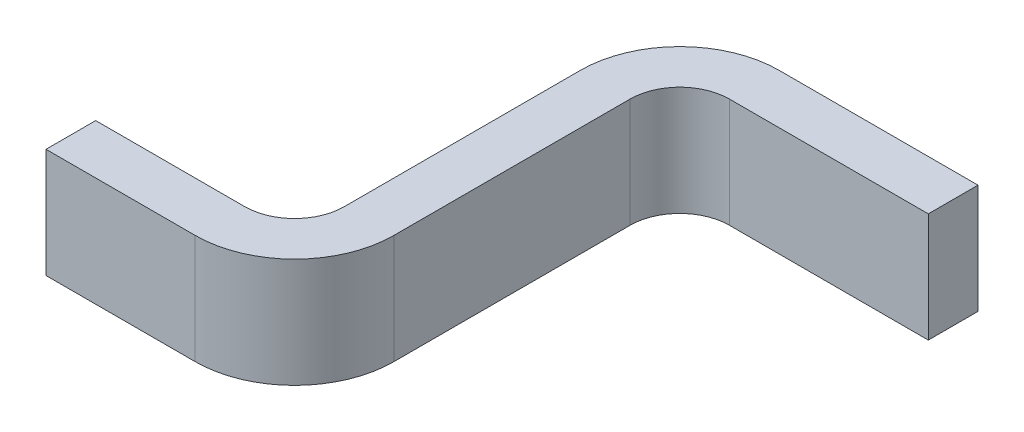
ISO-10303-21;
HEADER;
FILE_DESCRIPTION(('STEP AP214'),'2;1');
FILE_NAME('part.step','',(''),(''),'','','');
FILE_SCHEMA(('AUTOMOTIVE_DESIGN { 1 0 10303 214 1 1 1 1 }'));
ENDSEC;
DATA;
#1=APPLICATION_CONTEXT('core data for automotive mechanical design processes');
#2=APPLICATION_PROTOCOL_DEFINITION('international standard','automotive_design',2000,#1);
#3=PRODUCT_CONTEXT('',#1,'mechanical');
#4=PRODUCT('Part','Part','',(#3));
#5=PRODUCT_RELATED_PRODUCT_CATEGORY('part','',(#4));
#6=PRODUCT_DEFINITION_FORMATION('','',#4);
#7=PRODUCT_DEFINITION_CONTEXT('part definition',#1,'design');
#8=PRODUCT_DEFINITION('design','',#6,#7);
#9=PRODUCT_DEFINITION_SHAPE('','',#8);
#10=(LENGTH_UNIT() NAMED_UNIT(*) SI_UNIT(.MILLI.,.METRE.));
#11=(NAMED_UNIT(*) PLANE_ANGLE_UNIT() SI_UNIT($,.RADIAN.));
#12=(NAMED_UNIT(*) SI_UNIT($,.STERADIAN.) SOLID_ANGLE_UNIT());
#13=UNCERTAINTY_MEASURE_WITH_UNIT(LENGTH_MEASURE(1.E-05),#10,'distance_accuracy_value','');
#14=(GEOMETRIC_REPRESENTATION_CONTEXT(3) GLOBAL_UNCERTAINTY_ASSIGNED_CONTEXT((#13)) GLOBAL_UNIT_ASSIGNED_CONTEXT((#10,
#11,#12)) REPRESENTATION_CONTEXT('',''));
#15=CARTESIAN_POINT('',(0.,0.,0.));
#16=DIRECTION('',(0.,0.,1.));
#17=DIRECTION('',(1.,0.,0.));
#18=AXIS2_PLACEMENT_3D('',#15,#16,#17);
#19=CARTESIAN_POINT('',(3.9,-2.64,0.675));
#20=DIRECTION('',(0.,-1.,0.));
#21=DIRECTION('',(0.,0.,-1.));
#22=AXIS2_PLACEMENT_3D('',#19,#20,#21);
#23=PLANE('',#22);
#24=CARTESIAN_POINT('',(3.80000000000001,-2.64000000000001,0.675));
#25=DIRECTION('',(0.,-1.,0.));
#26=DIRECTION('',(0.,0.,-1.));
#27=AXIS2_PLACEMENT_3D('',#24,#25,#26);
#28=CIRCLE('',#27,0.1);
#29=CARTESIAN_POINT('',(3.9,-2.64,0.675));
#30=VERTEX_POINT('',#29);
#31=CARTESIAN_POINT('',(3.80000000000001,-2.64000000000001,0.775));
#32=VERTEX_POINT('',#31);
#33=EDGE_CURVE('E162',#30,#32,#28,.T.);
#34=ORIENTED_EDGE('',*,*,#33,.T.);
#35=DIRECTION('',(1.,0.,0.));
#36=VECTOR('',#35,1.);
#37=CARTESIAN_POINT('',(3.5,-2.64,0.775));
#38=LINE('',#37,#36);
#39=CARTESIAN_POINT('',(3.5,-2.64,0.775));
#40=VERTEX_POINT('',#39);
#41=EDGE_CURVE('E120',#32,#40,#38,.F.);
#42=ORIENTED_EDGE('',*,*,#41,.T.);
#43=DIRECTION('',(0.,0.,1.));
#44=VECTOR('',#43,1.);
#45=CARTESIAN_POINT('',(3.5,-2.64,0.775));
#46=LINE('',#45,#44);
#47=CARTESIAN_POINT('',(3.5,-2.64,0.875));
#48=VERTEX_POINT('',#47);
#49=EDGE_CURVE('E116',#48,#40,#46,.F.);
#50=ORIENTED_EDGE('',*,*,#49,.F.);
#51=DIRECTION('',(-1.,0.,0.));
#52=VECTOR('',#51,1.);
#53=CARTESIAN_POINT('',(3.5,-2.64,0.875));
#54=LINE('',#53,#52);
#55=CARTESIAN_POINT('',(3.80000000000001,-2.64000000000001,0.875));
#56=VERTEX_POINT('',#55);
#57=EDGE_CURVE('E111',#48,#56,#54,.F.);
#58=ORIENTED_EDGE('',*,*,#57,.T.);
#59=CARTESIAN_POINT('',(3.80000000000001,-2.64000000000001,0.675));
#60=DIRECTION('',(0.,-1.,0.));
#61=DIRECTION('',(0.,0.,-1.));
#62=AXIS2_PLACEMENT_3D('',#59,#60,#61);
#63=CIRCLE('',#62,0.2);
#64=CARTESIAN_POINT('',(4.,-2.64,0.675));
#65=VERTEX_POINT('',#64);
#66=EDGE_CURVE('E102',#65,#56,#63,.T.);
#67=ORIENTED_EDGE('',*,*,#66,.F.);
#68=DIRECTION('',(0.,0.,1.));
#69=VECTOR('',#68,1.);
#70=CARTESIAN_POINT('',(4.,-2.64,0.675));
#71=LINE('',#70,#69);
#72=CARTESIAN_POINT('',(4.,-2.64,0.2));
#73=VERTEX_POINT('',#72);
#74=EDGE_CURVE('E98',#65,#73,#71,.F.);
#75=ORIENTED_EDGE('',*,*,#74,.T.);
#76=CARTESIAN_POINT('',(4.1,-2.64,0.2));
#77=DIRECTION('',(0.,1.,0.));
#78=DIRECTION('',(0.,0.,1.));
#79=AXIS2_PLACEMENT_3D('',#76,#77,#78);
#80=CIRCLE('',#79,0.1);
#81=CARTESIAN_POINT('',(4.1,-2.64,0.1));
#82=VERTEX_POINT('',#81);
#83=EDGE_CURVE('E20',#73,#82,#80,.F.);
#84=ORIENTED_EDGE('',*,*,#83,.T.);
#85=DIRECTION('',(-1.,0.,0.));
#86=VECTOR('',#85,1.);
#87=CARTESIAN_POINT('',(4.1,-2.64,0.1));
#88=LINE('',#87,#86);
#89=CARTESIAN_POINT('',(4.5,-2.64,0.1));
#90=VERTEX_POINT('',#89);
#91=EDGE_CURVE('E145',#82,#90,#88,.F.);
#92=ORIENTED_EDGE('',*,*,#91,.T.);
#93=DIRECTION('',(0.,0.,1.));
#94=VECTOR('',#93,1.);
#95=CARTESIAN_POINT('',(4.5,-2.64,0.));
#96=LINE('',#95,#94);
#97=CARTESIAN_POINT('',(4.5,-2.64,0.));
#98=VERTEX_POINT('',#97);
#99=EDGE_CURVE('E139',#90,#98,#96,.F.);
#100=ORIENTED_EDGE('',*,*,#99,.T.);
#101=DIRECTION('',(1.,0.,0.));
#102=VECTOR('',#101,1.);
#103=CARTESIAN_POINT('',(4.1,-2.64,0.));
#104=LINE('',#103,#102);
#105=CARTESIAN_POINT('',(4.1,-2.64,0.));
#106=VERTEX_POINT('',#105);
#107=EDGE_CURVE('E132',#98,#106,#104,.F.);
#108=ORIENTED_EDGE('',*,*,#107,.T.);
#109=CARTESIAN_POINT('',(4.1,-2.64,0.2));
#110=DIRECTION('',(0.,1.,0.));
#111=DIRECTION('',(0.,0.,1.));
#112=AXIS2_PLACEMENT_3D('',#109,#110,#111);
#113=CIRCLE('',#112,0.2);
#114=CARTESIAN_POINT('',(3.9,-2.64,0.2));
#115=VERTEX_POINT('',#114);
#116=EDGE_CURVE('E135',#115,#106,#113,.F.);
#117=ORIENTED_EDGE('',*,*,#116,.F.);
#118=DIRECTION('',(0.,0.,-1.));
#119=VECTOR('',#118,1.);
#120=CARTESIAN_POINT('',(3.9,-2.64,0.675));
#121=LINE('',#120,#119);
#122=EDGE_CURVE('E128',#115,#30,#121,.F.);
#123=ORIENTED_EDGE('',*,*,#122,.T.);
#124=EDGE_LOOP('',(#34,#42,#50,#58,#67,#75,#84,#92,#100,#108,#117,#123));
#125=FACE_BOUND('',#124,.T.);
#126=ADVANCED_FACE('F17',(#125),#23,.F.);
#127=CARTESIAN_POINT('',(4.1,-2.64,0.2));
#128=DIRECTION('',(0.,1.,0.));
#129=DIRECTION('',(0.,0.,1.));
#130=AXIS2_PLACEMENT_3D('',#127,#128,#129);
#131=CYLINDRICAL_SURFACE('',#130,0.1);
#132=DIRECTION('',(0.,1.,0.));
#133=VECTOR('',#132,1.);
#134=CARTESIAN_POINT('',(4.,-2.64,0.2));
#135=LINE('',#134,#133);
#136=CARTESIAN_POINT('',(4.,-2.86,0.2));
#137=VERTEX_POINT('',#136);
#138=EDGE_CURVE('E91',#73,#137,#135,.F.);
#139=ORIENTED_EDGE('',*,*,#138,.T.);
#140=CARTESIAN_POINT('',(4.1,-2.86,0.2));
#141=DIRECTION('',(0.,1.,0.));
#142=DIRECTION('',(0.,0.,1.));
#143=AXIS2_PLACEMENT_3D('',#140,#141,#142);
#144=CIRCLE('',#143,0.1);
#145=CARTESIAN_POINT('',(4.1,-2.86,0.1));
#146=VERTEX_POINT('',#145);
#147=EDGE_CURVE('E103',#137,#146,#144,.F.);
#148=ORIENTED_EDGE('',*,*,#147,.T.);
#149=DIRECTION('',(0.,1.,0.));
#150=VECTOR('',#149,1.);
#151=CARTESIAN_POINT('',(4.1,-2.64,0.1));
#152=LINE('',#151,#150);
#153=EDGE_CURVE('E92',#146,#82,#152,.T.);
#154=ORIENTED_EDGE('',*,*,#153,.T.);
#155=ORIENTED_EDGE('',*,*,#83,.F.);
#156=EDGE_LOOP('',(#139,#148,#154,#155));
#157=FACE_BOUND('',#156,.T.);
#158=ADVANCED_FACE('F89',(#157),#131,.F.);
#159=CARTESIAN_POINT('',(4.1,-2.64,0.1));
#160=DIRECTION('',(0.,0.,-1.));
#161=DIRECTION('',(-1.,0.,0.));
#162=AXIS2_PLACEMENT_3D('',#159,#160,#161);
#163=PLANE('',#162);
#164=ORIENTED_EDGE('',*,*,#153,.F.);
#165=DIRECTION('',(1.,0.,0.));
#166=VECTOR('',#165,1.);
#167=CARTESIAN_POINT('',(4.,-2.86,0.1));
#168=LINE('',#167,#166);
#169=CARTESIAN_POINT('',(4.5,-2.86,0.1));
#170=VERTEX_POINT('',#169);
#171=EDGE_CURVE('E105',#146,#170,#168,.T.);
#172=ORIENTED_EDGE('',*,*,#171,.T.);
#173=DIRECTION('',(0.,1.,0.));
#174=VECTOR('',#173,1.);
#175=CARTESIAN_POINT('',(4.5,-2.86,0.1));
#176=LINE('',#175,#174);
#177=EDGE_CURVE('E142',#170,#90,#176,.T.);
#178=ORIENTED_EDGE('',*,*,#177,.T.);
#179=ORIENTED_EDGE('',*,*,#91,.F.);
#180=EDGE_LOOP('',(#164,#172,#178,#179));
#181=FACE_BOUND('',#180,.T.);
#182=ADVANCED_FACE('F187',(#181),#163,.F.);
#183=CARTESIAN_POINT('',(4.5,-2.86,0.));
#184=DIRECTION('',(-1.,0.,0.));
#185=DIRECTION('',(0.,0.,1.));
#186=AXIS2_PLACEMENT_3D('',#183,#184,#185);
#187=PLANE('',#186);
#188=ORIENTED_EDGE('',*,*,#177,.F.);
#189=DIRECTION('',(0.,0.,1.));
#190=VECTOR('',#189,1.);
#191=CARTESIAN_POINT('',(4.5,-2.86,0.675));
#192=LINE('',#191,#190);
#193=CARTESIAN_POINT('',(4.5,-2.86,0.));
#194=VERTEX_POINT('',#193);
#195=EDGE_CURVE('E176',#170,#194,#192,.F.);
#196=ORIENTED_EDGE('',*,*,#195,.T.);
#197=DIRECTION('',(0.,1.,0.));
#198=VECTOR('',#197,1.);
#199=CARTESIAN_POINT('',(4.5,-2.86,0.));
#200=LINE('',#199,#198);
#201=EDGE_CURVE('E136',#194,#98,#200,.T.);
#202=ORIENTED_EDGE('',*,*,#201,.T.);
#203=ORIENTED_EDGE('',*,*,#99,.F.);
#204=EDGE_LOOP('',(#188,#196,#202,#203));
#205=FACE_BOUND('',#204,.T.);
#206=ADVANCED_FACE('F192',(#205),#187,.F.);
#207=CARTESIAN_POINT('',(4.1,-2.86,0.));
#208=DIRECTION('',(0.,0.,1.));
#209=DIRECTION('',(1.,0.,0.));
#210=AXIS2_PLACEMENT_3D('',#207,#208,#209);
#211=PLANE('',#210);
#212=DIRECTION('',(0.,1.,0.));
#213=VECTOR('',#212,1.);
#214=CARTESIAN_POINT('',(4.1,-2.86,0.));
#215=LINE('',#214,#213);
#216=CARTESIAN_POINT('',(4.1,-2.86,0.));
#217=VERTEX_POINT('',#216);
#218=EDGE_CURVE('E163',#106,#217,#215,.F.);
#219=ORIENTED_EDGE('',*,*,#218,.F.);
#220=ORIENTED_EDGE('',*,*,#107,.F.);
#221=ORIENTED_EDGE('',*,*,#201,.F.);
#222=DIRECTION('',(1.,0.,0.));
#223=VECTOR('',#222,1.);
#224=CARTESIAN_POINT('',(4.,-2.86,0.));
#225=LINE('',#224,#223);
#226=EDGE_CURVE('E159',#194,#217,#225,.F.);
#227=ORIENTED_EDGE('',*,*,#226,.T.);
#228=EDGE_LOOP('',(#219,#220,#221,#227));
#229=FACE_BOUND('',#228,.T.);
#230=ADVANCED_FACE('F264',(#229),#211,.F.);
#231=CARTESIAN_POINT('',(4.1,-2.86,0.2));
#232=DIRECTION('',(0.,1.,0.));
#233=DIRECTION('',(0.,0.,1.));
#234=AXIS2_PLACEMENT_3D('',#231,#232,#233);
#235=CYLINDRICAL_SURFACE('',#234,0.2);
#236=ORIENTED_EDGE('',*,*,#116,.T.);
#237=ORIENTED_EDGE('',*,*,#218,.T.);
#238=CARTESIAN_POINT('',(4.1,-2.86,0.2));
#239=DIRECTION('',(0.,1.,0.));
#240=DIRECTION('',(0.,0.,1.));
#241=AXIS2_PLACEMENT_3D('',#238,#239,#240);
#242=CIRCLE('',#241,0.2);
#243=CARTESIAN_POINT('',(3.9,-2.86,0.2));
#244=VERTEX_POINT('',#243);
#245=EDGE_CURVE('E157',#217,#244,#242,.T.);
#246=ORIENTED_EDGE('',*,*,#245,.T.);
#247=DIRECTION('',(0.,1.,0.));
#248=VECTOR('',#247,1.);
#249=CARTESIAN_POINT('',(3.9,-2.86,0.2));
#250=LINE('',#249,#248);
#251=EDGE_CURVE('E131',#244,#115,#250,.T.);
#252=ORIENTED_EDGE('',*,*,#251,.T.);
#253=EDGE_LOOP('',(#236,#237,#246,#252));
#254=FACE_BOUND('',#253,.T.);
#255=ADVANCED_FACE('F266',(#254),#235,.T.);
#256=CARTESIAN_POINT('',(3.9,-2.86,0.675));
#257=DIRECTION('',(1.,0.,0.));
#258=DIRECTION('',(0.,0.,-1.));
#259=AXIS2_PLACEMENT_3D('',#256,#257,#258);
#260=PLANE('',#259);
#261=DIRECTION('',(0.,-1.,0.));
#262=VECTOR('',#261,1.);
#263=CARTESIAN_POINT('',(3.9,-2.86,0.675));
#264=LINE('',#263,#262);
#265=CARTESIAN_POINT('',(3.9,-2.86,0.675));
#266=VERTEX_POINT('',#265);
#267=EDGE_CURVE('E130',#266,#30,#264,.F.);
#268=ORIENTED_EDGE('',*,*,#267,.T.);
#269=ORIENTED_EDGE('',*,*,#122,.F.);
#270=ORIENTED_EDGE('',*,*,#251,.F.);
#271=DIRECTION('',(0.,0.,1.));
#272=VECTOR('',#271,1.);
#273=CARTESIAN_POINT('',(3.9,-2.86,0.675));
#274=LINE('',#273,#272);
#275=EDGE_CURVE('E156',#244,#266,#274,.T.);
#276=ORIENTED_EDGE('',*,*,#275,.T.);
#277=EDGE_LOOP('',(#268,#269,#270,#276));
#278=FACE_BOUND('',#277,.T.);
#279=ADVANCED_FACE('F231',(#278),#260,.F.);
#280=CARTESIAN_POINT('',(3.8,-2.86,0.675));
#281=DIRECTION('',(0.,-1.,0.));
#282=DIRECTION('',(0.,0.,-1.));
#283=AXIS2_PLACEMENT_3D('',#280,#281,#282);
#284=CYLINDRICAL_SURFACE('',#283,0.1);
#285=DIRECTION('',(0.,1.,0.));
#286=VECTOR('',#285,1.);
#287=CARTESIAN_POINT('',(3.8,-2.86,0.775));
#288=LINE('',#287,#286);
#289=CARTESIAN_POINT('',(3.8,-2.86,0.775));
#290=VERTEX_POINT('',#289);
#291=EDGE_CURVE('E125',#290,#32,#288,.T.);
#292=ORIENTED_EDGE('',*,*,#291,.T.);
#293=ORIENTED_EDGE('',*,*,#33,.F.);
#294=ORIENTED_EDGE('',*,*,#267,.F.);
#295=CARTESIAN_POINT('',(3.8,-2.86,0.675));
#296=DIRECTION('',(0.,-1.,0.));
#297=DIRECTION('',(0.,0.,-1.));
#298=AXIS2_PLACEMENT_3D('',#295,#296,#297);
#299=CIRCLE('',#298,0.1);
#300=EDGE_CURVE('E152',#266,#290,#299,.T.);
#301=ORIENTED_EDGE('',*,*,#300,.T.);
#302=EDGE_LOOP('',(#292,#293,#294,#301));
#303=FACE_BOUND('',#302,.T.);
#304=ADVANCED_FACE('F235',(#303),#284,.F.);
#305=CARTESIAN_POINT('',(3.5,-2.86,0.775));
#306=DIRECTION('',(0.,0.,1.));
#307=DIRECTION('',(1.,0.,0.));
#308=AXIS2_PLACEMENT_3D('',#305,#306,#307);
#309=PLANE('',#308);
#310=DIRECTION('',(0.,1.,0.));
#311=VECTOR('',#310,1.);
#312=CARTESIAN_POINT('',(3.5,-2.86,0.775));
#313=LINE('',#312,#311);
#314=CARTESIAN_POINT('',(3.5,-2.86,0.775));
#315=VERTEX_POINT('',#314);
#316=EDGE_CURVE('E119',#40,#315,#313,.F.);
#317=ORIENTED_EDGE('',*,*,#316,.F.);
#318=ORIENTED_EDGE('',*,*,#41,.F.);
#319=ORIENTED_EDGE('',*,*,#291,.F.);
#320=DIRECTION('',(1.,0.,0.));
#321=VECTOR('',#320,1.);
#322=CARTESIAN_POINT('',(4.,-2.86,0.775));
#323=LINE('',#322,#321);
#324=EDGE_CURVE('E155',#290,#315,#323,.F.);
#325=ORIENTED_EDGE('',*,*,#324,.T.);
#326=EDGE_LOOP('',(#317,#318,#319,#325));
#327=FACE_BOUND('',#326,.T.);
#328=ADVANCED_FACE('F259',(#327),#309,.F.);
#329=CARTESIAN_POINT('',(3.5,-2.86,0.775));
#330=DIRECTION('',(-1.,0.,0.));
#331=DIRECTION('',(0.,0.,1.));
#332=AXIS2_PLACEMENT_3D('',#329,#330,#331);
#333=PLANE('',#332);
#334=DIRECTION('',(0.,0.,1.));
#335=VECTOR('',#334,1.);
#336=CARTESIAN_POINT('',(3.5,-2.86,0.675));
#337=LINE('',#336,#335);
#338=CARTESIAN_POINT('',(3.5,-2.86,0.875));
#339=VERTEX_POINT('',#338);
#340=EDGE_CURVE('E217',#315,#339,#337,.T.);
#341=ORIENTED_EDGE('',*,*,#340,.T.);
#342=DIRECTION('',(0.,1.,0.));
#343=VECTOR('',#342,1.);
#344=CARTESIAN_POINT('',(3.5,-2.64,0.875));
#345=LINE('',#344,#343);
#346=EDGE_CURVE('E113',#339,#48,#345,.T.);
#347=ORIENTED_EDGE('',*,*,#346,.T.);
#348=ORIENTED_EDGE('',*,*,#49,.T.);
#349=ORIENTED_EDGE('',*,*,#316,.T.);
#350=EDGE_LOOP('',(#341,#347,#348,#349));
#351=FACE_BOUND('',#350,.T.);
#352=ADVANCED_FACE('F255',(#351),#333,.T.);
#353=CARTESIAN_POINT('',(3.5,-2.64,0.875));
#354=DIRECTION('',(0.,0.,-1.));
#355=DIRECTION('',(-1.,0.,0.));
#356=AXIS2_PLACEMENT_3D('',#353,#354,#355);
#357=PLANE('',#356);
#358=ORIENTED_EDGE('',*,*,#346,.F.);
#359=DIRECTION('',(1.,0.,0.));
#360=VECTOR('',#359,1.);
#361=CARTESIAN_POINT('',(4.,-2.86,0.875));
#362=LINE('',#361,#360);
#363=CARTESIAN_POINT('',(3.8,-2.86,0.875));
#364=VERTEX_POINT('',#363);
#365=EDGE_CURVE('E151',#339,#364,#362,.T.);
#366=ORIENTED_EDGE('',*,*,#365,.T.);
#367=DIRECTION('',(0.,-1.,0.));
#368=VECTOR('',#367,1.);
#369=CARTESIAN_POINT('',(3.80000000000001,-2.64000000000001,0.875));
#370=LINE('',#369,#368);
#371=EDGE_CURVE('E99',#56,#364,#370,.T.);
#372=ORIENTED_EDGE('',*,*,#371,.F.);
#373=ORIENTED_EDGE('',*,*,#57,.F.);
#374=EDGE_LOOP('',(#358,#366,#372,#373));
#375=FACE_BOUND('',#374,.T.);
#376=ADVANCED_FACE('F251',(#375),#357,.F.);
#377=CARTESIAN_POINT('',(3.80000000000001,-2.64000000000001,0.675));
#378=DIRECTION('',(0.,-1.,0.));
#379=DIRECTION('',(0.,0.,-1.));
#380=AXIS2_PLACEMENT_3D('',#377,#378,#379);
#381=CYLINDRICAL_SURFACE('',#380,0.2);
#382=CARTESIAN_POINT('',(3.8,-2.86,0.675));
#383=DIRECTION('',(0.,-1.,0.));
#384=DIRECTION('',(0.,0.,-1.));
#385=AXIS2_PLACEMENT_3D('',#382,#383,#384);
#386=CIRCLE('',#385,0.2);
#387=CARTESIAN_POINT('',(4.,-2.86,0.675));
#388=VERTEX_POINT('',#387);
#389=EDGE_CURVE('E26',#364,#388,#386,.F.);
#390=ORIENTED_EDGE('',*,*,#389,.T.);
#391=DIRECTION('',(0.,1.,0.));
#392=VECTOR('',#391,1.);
#393=CARTESIAN_POINT('',(4.,-2.64,0.675));
#394=LINE('',#393,#392);
#395=EDGE_CURVE('E34',#388,#65,#394,.T.);
#396=ORIENTED_EDGE('',*,*,#395,.T.);
#397=ORIENTED_EDGE('',*,*,#66,.T.);
#398=ORIENTED_EDGE('',*,*,#371,.T.);
#399=EDGE_LOOP('',(#390,#396,#397,#398));
#400=FACE_BOUND('',#399,.T.);
#401=ADVANCED_FACE('F280',(#400),#381,.T.);
#402=CARTESIAN_POINT('',(4.,-2.64,0.675));
#403=DIRECTION('',(-1.,0.,0.));
#404=DIRECTION('',(0.,0.,1.));
#405=AXIS2_PLACEMENT_3D('',#402,#403,#404);
#406=PLANE('',#405);
#407=ORIENTED_EDGE('',*,*,#395,.F.);
#408=DIRECTION('',(0.,0.,1.));
#409=VECTOR('',#408,1.);
#410=CARTESIAN_POINT('',(4.,-2.86,0.675));
#411=LINE('',#410,#409);
#412=EDGE_CURVE('E11',#388,#137,#411,.F.);
#413=ORIENTED_EDGE('',*,*,#412,.T.);
#414=ORIENTED_EDGE('',*,*,#138,.F.);
#415=ORIENTED_EDGE('',*,*,#74,.F.);
#416=EDGE_LOOP('',(#407,#413,#414,#415));
#417=FACE_BOUND('',#416,.T.);
#418=ADVANCED_FACE('F97',(#417),#406,.F.);
#419=CARTESIAN_POINT('',(4.,-2.86,0.675));
#420=DIRECTION('',(0.,1.,0.));
#421=DIRECTION('',(0.,0.,1.));
#422=AXIS2_PLACEMENT_3D('',#419,#420,#421);
#423=PLANE('',#422);
#424=ORIENTED_EDGE('',*,*,#389,.F.);
#425=ORIENTED_EDGE('',*,*,#365,.F.);
#426=ORIENTED_EDGE('',*,*,#340,.F.);
#427=ORIENTED_EDGE('',*,*,#324,.F.);
#428=ORIENTED_EDGE('',*,*,#300,.F.);
#429=ORIENTED_EDGE('',*,*,#275,.F.);
#430=ORIENTED_EDGE('',*,*,#245,.F.);
#431=ORIENTED_EDGE('',*,*,#226,.F.);
#432=ORIENTED_EDGE('',*,*,#195,.F.);
#433=ORIENTED_EDGE('',*,*,#171,.F.);
#434=ORIENTED_EDGE('',*,*,#147,.F.);
#435=ORIENTED_EDGE('',*,*,#412,.F.);
#436=EDGE_LOOP('',(#424,#425,#426,#427,#428,#429,#430,#431,#432,#433,#434,#435));
#437=FACE_BOUND('',#436,.T.);
#438=ADVANCED_FACE('F197',(#437),#423,.F.);
#439=CLOSED_SHELL('',(#126,#158,#182,#206,#230,#255,#279,#304,#328,#352,#376,#401,#418,#438));
#440=MANIFOLD_SOLID_BREP('B1',#439);
#441=ADVANCED_BREP_SHAPE_REPRESENTATION('',(#18,#440),#14);
#442=SHAPE_DEFINITION_REPRESENTATION(#9,#441);
ENDSEC;
END-ISO-10303-21;
